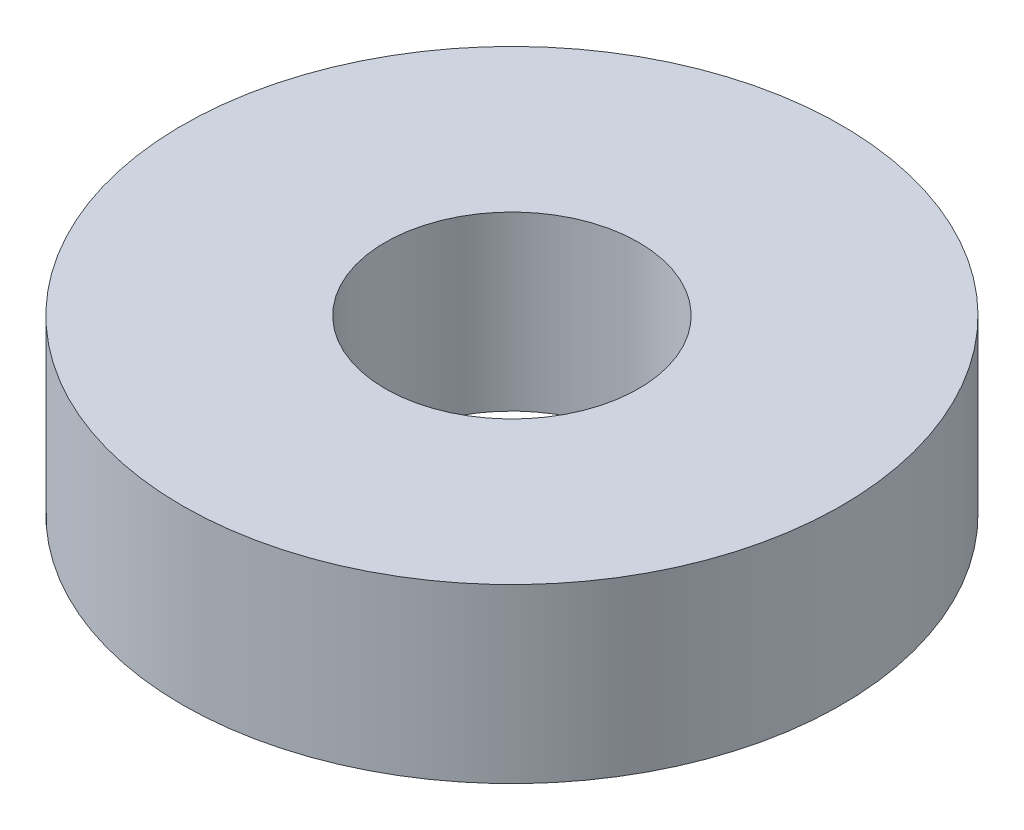
ISO-10303-21;
HEADER;
FILE_DESCRIPTION(('STEP AP214'),'2;1');
FILE_NAME('part.step','',(''),(''),'','','');
FILE_SCHEMA(('AUTOMOTIVE_DESIGN { 1 0 10303 214 1 1 1 1 }'));
ENDSEC;
DATA;
#1=APPLICATION_CONTEXT('core data for automotive mechanical design processes');
#2=APPLICATION_PROTOCOL_DEFINITION('international standard','automotive_design',2000,#1);
#3=PRODUCT_CONTEXT('',#1,'mechanical');
#4=PRODUCT('Part','Part','',(#3));
#5=PRODUCT_RELATED_PRODUCT_CATEGORY('part','',(#4));
#6=PRODUCT_DEFINITION_FORMATION('','',#4);
#7=PRODUCT_DEFINITION_CONTEXT('part definition',#1,'design');
#8=PRODUCT_DEFINITION('design','',#6,#7);
#9=PRODUCT_DEFINITION_SHAPE('','',#8);
#10=(LENGTH_UNIT() NAMED_UNIT(*) SI_UNIT(.MILLI.,.METRE.));
#11=(NAMED_UNIT(*) PLANE_ANGLE_UNIT() SI_UNIT($,.RADIAN.));
#12=(NAMED_UNIT(*) SI_UNIT($,.STERADIAN.) SOLID_ANGLE_UNIT());
#13=UNCERTAINTY_MEASURE_WITH_UNIT(LENGTH_MEASURE(1.E-05),#10,'distance_accuracy_value','');
#14=(GEOMETRIC_REPRESENTATION_CONTEXT(3) GLOBAL_UNCERTAINTY_ASSIGNED_CONTEXT((#13)) GLOBAL_UNIT_ASSIGNED_CONTEXT((#10,
#11,#12)) REPRESENTATION_CONTEXT('',''));
#15=CARTESIAN_POINT('',(0.,0.,0.));
#16=DIRECTION('',(0.,0.,1.));
#17=DIRECTION('',(1.,0.,0.));
#18=AXIS2_PLACEMENT_3D('',#15,#16,#17);
#19=CARTESIAN_POINT('',(0.,17.,0.));
#20=DIRECTION('',(0.,-1.,0.));
#21=DIRECTION('',(0.,0.,-1.));
#22=AXIS2_PLACEMENT_3D('',#19,#20,#21);
#23=CYLINDRICAL_SURFACE('',#22,32.5);
#24=CARTESIAN_POINT('',(0.,17.,0.));
#25=DIRECTION('',(0.,1.,0.));
#26=DIRECTION('',(0.,0.,1.));
#27=AXIS2_PLACEMENT_3D('',#24,#25,#26);
#28=CIRCLE('',#27,32.5);
#29=CARTESIAN_POINT('',(0.,17.,32.5));
#30=VERTEX_POINT('',#29);
#31=EDGE_CURVE('E10',#30,#30,#28,.T.);
#32=ORIENTED_EDGE('',*,*,#31,.F.);
#33=EDGE_LOOP('',(#32));
#34=FACE_BOUND('',#33,.T.);
#35=CARTESIAN_POINT('',(0.,0.,0.));
#36=DIRECTION('',(0.,1.,0.));
#37=DIRECTION('',(0.,0.,1.));
#38=AXIS2_PLACEMENT_3D('',#35,#36,#37);
#39=CIRCLE('',#38,32.5);
#40=CARTESIAN_POINT('',(0.,0.,32.5));
#41=VERTEX_POINT('',#40);
#42=EDGE_CURVE('E37',#41,#41,#39,.T.);
#43=ORIENTED_EDGE('',*,*,#42,.T.);
#44=EDGE_LOOP('',(#43));
#45=FACE_BOUND('',#44,.T.);
#46=ADVANCED_FACE('F40',(#34,#45),#23,.T.);
#47=CARTESIAN_POINT('',(0.,17.,0.));
#48=DIRECTION('',(0.,1.,0.));
#49=DIRECTION('',(0.,0.,1.));
#50=AXIS2_PLACEMENT_3D('',#47,#48,#49);
#51=PLANE('',#50);
#52=CARTESIAN_POINT('',(0.,17.,0.));
#53=DIRECTION('',(0.,1.,0.));
#54=DIRECTION('',(0.,0.,1.));
#55=AXIS2_PLACEMENT_3D('',#52,#53,#54);
#56=CIRCLE('',#55,12.5);
#57=CARTESIAN_POINT('',(0.,17.,12.5));
#58=VERTEX_POINT('',#57);
#59=EDGE_CURVE('E50',#58,#58,#56,.T.);
#60=ORIENTED_EDGE('',*,*,#59,.F.);
#61=EDGE_LOOP('',(#60));
#62=FACE_BOUND('',#61,.T.);
#63=ORIENTED_EDGE('',*,*,#31,.T.);
#64=EDGE_LOOP('',(#63));
#65=FACE_BOUND('',#64,.T.);
#66=ADVANCED_FACE('F59',(#62,#65),#51,.T.);
#67=CARTESIAN_POINT('',(0.,0.,0.));
#68=DIRECTION('',(0.,1.,0.));
#69=DIRECTION('',(0.,0.,1.));
#70=AXIS2_PLACEMENT_3D('',#67,#68,#69);
#71=PLANE('',#70);
#72=CARTESIAN_POINT('',(0.,0.,0.));
#73=DIRECTION('',(0.,1.,0.));
#74=DIRECTION('',(0.,0.,1.));
#75=AXIS2_PLACEMENT_3D('',#72,#73,#74);
#76=CIRCLE('',#75,12.5);
#77=CARTESIAN_POINT('',(0.,0.,12.5));
#78=VERTEX_POINT('',#77);
#79=EDGE_CURVE('E47',#78,#78,#76,.T.);
#80=ORIENTED_EDGE('',*,*,#79,.T.);
#81=EDGE_LOOP('',(#80));
#82=FACE_BOUND('',#81,.T.);
#83=ORIENTED_EDGE('',*,*,#42,.F.);
#84=EDGE_LOOP('',(#83));
#85=FACE_BOUND('',#84,.T.);
#86=ADVANCED_FACE('F58',(#82,#85),#71,.F.);
#87=CARTESIAN_POINT('',(0.,17.,0.));
#88=DIRECTION('',(0.,-1.,0.));
#89=DIRECTION('',(0.,0.,-1.));
#90=AXIS2_PLACEMENT_3D('',#87,#88,#89);
#91=CYLINDRICAL_SURFACE('',#90,12.5);
#92=ORIENTED_EDGE('',*,*,#59,.T.);
#93=EDGE_LOOP('',(#92));
#94=FACE_BOUND('',#93,.T.);
#95=ORIENTED_EDGE('',*,*,#79,.F.);
#96=EDGE_LOOP('',(#95));
#97=FACE_BOUND('',#96,.T.);
#98=ADVANCED_FACE('F54',(#94,#97),#91,.F.);
#99=CLOSED_SHELL('',(#46,#66,#86,#98));
#100=MANIFOLD_SOLID_BREP('B2',#99);
#101=ADVANCED_BREP_SHAPE_REPRESENTATION('',(#18,#100),#14);
#102=SHAPE_DEFINITION_REPRESENTATION(#9,#101);
ENDSEC;
END-ISO-10303-21;
